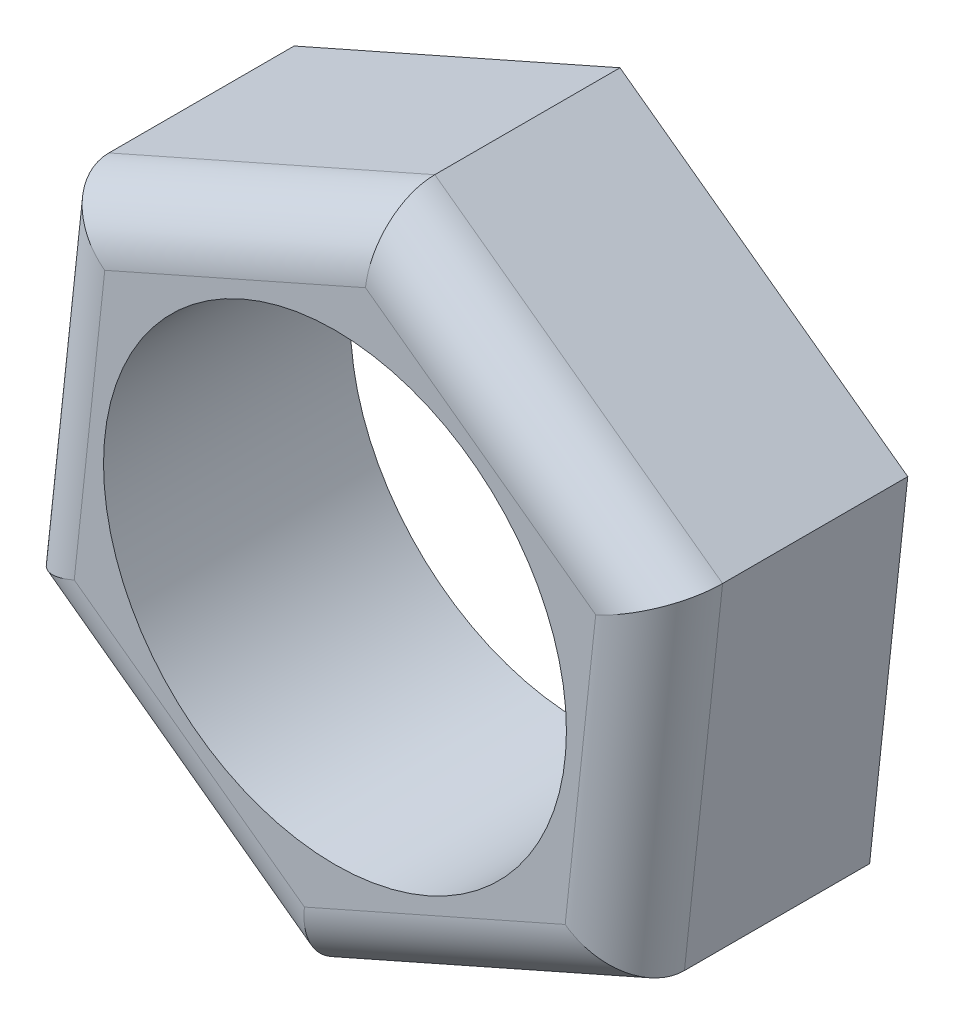
ISO-10303-21;
HEADER;
FILE_DESCRIPTION(('STEP AP214'),'2;1');
FILE_NAME('part.step','',(''),(''),'','','');
FILE_SCHEMA(('AUTOMOTIVE_DESIGN { 1 0 10303 214 1 1 1 1 }'));
ENDSEC;
DATA;
#1=APPLICATION_CONTEXT('core data for automotive mechanical design processes');
#2=APPLICATION_PROTOCOL_DEFINITION('international standard','automotive_design',2000,#1);
#3=PRODUCT_CONTEXT('',#1,'mechanical');
#4=PRODUCT('Part','Part','',(#3));
#5=PRODUCT_RELATED_PRODUCT_CATEGORY('part','',(#4));
#6=PRODUCT_DEFINITION_FORMATION('','',#4);
#7=PRODUCT_DEFINITION_CONTEXT('part definition',#1,'design');
#8=PRODUCT_DEFINITION('design','',#6,#7);
#9=PRODUCT_DEFINITION_SHAPE('','',#8);
#10=(LENGTH_UNIT() NAMED_UNIT(*) SI_UNIT(.MILLI.,.METRE.));
#11=(NAMED_UNIT(*) PLANE_ANGLE_UNIT() SI_UNIT($,.RADIAN.));
#12=(NAMED_UNIT(*) SI_UNIT($,.STERADIAN.) SOLID_ANGLE_UNIT());
#13=UNCERTAINTY_MEASURE_WITH_UNIT(LENGTH_MEASURE(1.E-05),#10,'distance_accuracy_value','');
#14=(GEOMETRIC_REPRESENTATION_CONTEXT(3) GLOBAL_UNCERTAINTY_ASSIGNED_CONTEXT((#13)) GLOBAL_UNIT_ASSIGNED_CONTEXT((#10,
#11,#12)) REPRESENTATION_CONTEXT('',''));
#15=CARTESIAN_POINT('',(0.,0.,0.));
#16=DIRECTION('',(0.,0.,1.));
#17=DIRECTION('',(1.,0.,0.));
#18=AXIS2_PLACEMENT_3D('',#15,#16,#17);
#19=CARTESIAN_POINT('',(0.,0.,5.07999999999997));
#20=DIRECTION('',(0.,0.,1.));
#21=DIRECTION('',(1.00000000000002,0.,0.));
#22=AXIS2_PLACEMENT_3D('',#19,#20,#21);
#23=PLANE('',#22);
#24=DIRECTION('',(-0.107052795571774,-0.994253337414733,0.));
#25=VECTOR('',#24,1.);
#26=CARTESIAN_POINT('',(-5.44328115223156,-3.10127774168979,5.07999999999997));
#27=LINE('',#26,#25);
#28=CARTESIAN_POINT('',(-4.73682759553516,3.45991295605974,5.07999999999997));
#29=VERTEX_POINT('',#28);
#30=CARTESIAN_POINT('',(-5.36478631260001,-2.37225655305162,5.07999999999997));
#31=VERTEX_POINT('',#30);
#32=EDGE_CURVE('E155',#29,#31,#27,.T.);
#33=ORIENTED_EDGE('',*,*,#32,.T.);
#34=DIRECTION('',(0.807522250212721,-0.589837109218645,0.));
#35=VECTOR('',#34,1.);
#36=CARTESIAN_POINT('',(-0.0358552676213153,-6.26465862861823,5.07999999999997));
#37=LINE('',#36,#35);
#38=CARTESIAN_POINT('',(-0.627958717063656,-5.83216950911078,5.07999999999997));
#39=VERTEX_POINT('',#38);
#40=EDGE_CURVE('E163',#31,#39,#37,.T.);
#41=ORIENTED_EDGE('',*,*,#40,.T.);
#42=DIRECTION('',(0.914575045784498,0.404416228196088,0.));
#43=VECTOR('',#42,1.);
#44=CARTESIAN_POINT('',(5.40742588460988,-3.16338088692858,5.07999999999997));
#45=LINE('',#44,#43);
#46=CARTESIAN_POINT('',(4.73682759553512,-3.45991295605977,5.07999999999997));
#47=VERTEX_POINT('',#46);
#48=EDGE_CURVE('E161',#39,#47,#45,.T.);
#49=ORIENTED_EDGE('',*,*,#48,.T.);
#50=DIRECTION('',(0.107052795571774,0.994253337414734,0.));
#51=VECTOR('',#50,1.);
#52=CARTESIAN_POINT('',(5.44328115223112,3.10127774168945,5.07999999999997));
#53=LINE('',#52,#51);
#54=CARTESIAN_POINT('',(5.36478631259799,2.37225655305062,5.07999999999997));
#55=VERTEX_POINT('',#54);
#56=EDGE_CURVE('E159',#47,#55,#53,.T.);
#57=ORIENTED_EDGE('',*,*,#56,.T.);
#58=DIRECTION('',(-0.807522250212718,0.589837109218643,0.));
#59=VECTOR('',#58,1.);
#60=CARTESIAN_POINT('',(0.0358552676211488,6.26465862861791,5.07999999999997));
#61=LINE('',#60,#59);
#62=CARTESIAN_POINT('',(0.627958717063143,5.83216950911047,5.07999999999997));
#63=VERTEX_POINT('',#62);
#64=EDGE_CURVE('E157',#55,#63,#61,.T.);
#65=ORIENTED_EDGE('',*,*,#64,.T.);
#66=DIRECTION('',(-0.914575045784497,-0.404416228196088,0.));
#67=VECTOR('',#66,1.);
#68=CARTESIAN_POINT('',(-5.40742588461005,3.16338088692839,5.07999999999997));
#69=LINE('',#68,#67);
#70=EDGE_CURVE('E113',#63,#29,#69,.T.);
#71=ORIENTED_EDGE('',*,*,#70,.T.);
#72=EDGE_LOOP('',(#33,#41,#49,#57,#65,#71));
#73=FACE_BOUND('',#72,.T.);
#74=CARTESIAN_POINT('',(0.,0.,5.07999999999997));
#75=DIRECTION('',(0.,0.,1.));
#76=DIRECTION('',(1.00000000000002,0.,0.));
#77=AXIS2_PLACEMENT_3D('',#74,#75,#76);
#78=CIRCLE('',#77,4.7625);
#79=CARTESIAN_POINT('',(4.76250000000011,0.,5.07999999999997));
#80=VERTEX_POINT('',#79);
#81=EDGE_CURVE('E130',#80,#80,#78,.T.);
#82=ORIENTED_EDGE('',*,*,#81,.F.);
#83=EDGE_LOOP('',(#82));
#84=FACE_BOUND('',#83,.T.);
#85=ADVANCED_FACE('F32',(#73,#84),#23,.T.);
#86=CARTESIAN_POINT('',(0.,0.,0.));
#87=DIRECTION('',(0.,0.,1.));
#88=DIRECTION('',(1.00000000000002,0.,0.));
#89=AXIS2_PLACEMENT_3D('',#86,#87,#88);
#90=PLANE('',#89);
#91=DIRECTION('',(0.107052795571774,0.994253337414734,0.));
#92=VECTOR('',#91,1.);
#93=CARTESIAN_POINT('',(5.9210344944189,-4.32489119507476,0.));
#94=LINE('',#93,#92);
#95=CARTESIAN_POINT('',(5.9210344944189,-4.32489119507476,0.));
#96=VERTEX_POINT('',#95);
#97=CARTESIAN_POINT('',(6.70598289074778,2.96532069131339,0.));
#98=VERTEX_POINT('',#97);
#99=EDGE_CURVE('E121',#96,#98,#94,.T.);
#100=ORIENTED_EDGE('',*,*,#99,.F.);
#101=DIRECTION('',(0.914575045784497,0.404416228196088,0.));
#102=VECTOR('',#101,1.);
#103=CARTESIAN_POINT('',(-0.784948396328949,-7.29021188638812,0.));
#104=LINE('',#103,#102);
#105=CARTESIAN_POINT('',(-0.784948396328949,-7.29021188638812,0.));
#106=VERTEX_POINT('',#105);
#107=EDGE_CURVE('E144',#106,#96,#104,.T.);
#108=ORIENTED_EDGE('',*,*,#107,.F.);
#109=DIRECTION('',(0.807522250212718,-0.589837109218643,0.));
#110=VECTOR('',#109,1.);
#111=CARTESIAN_POINT('',(-6.70598289074804,-2.96532069131353,0.));
#112=LINE('',#111,#110);
#113=CARTESIAN_POINT('',(-6.70598289074804,-2.96532069131353,0.));
#114=VERTEX_POINT('',#113);
#115=EDGE_CURVE('E141',#114,#106,#112,.T.);
#116=ORIENTED_EDGE('',*,*,#115,.F.);
#117=DIRECTION('',(-0.107052795571774,-0.994253337414734,0.));
#118=VECTOR('',#117,1.);
#119=CARTESIAN_POINT('',(-5.92103449441898,4.32489119507473,0.));
#120=LINE('',#119,#118);
#121=CARTESIAN_POINT('',(-5.92103449441898,4.32489119507473,0.));
#122=VERTEX_POINT('',#121);
#123=EDGE_CURVE('E138',#122,#114,#120,.T.);
#124=ORIENTED_EDGE('',*,*,#123,.F.);
#125=DIRECTION('',(-0.914575045784497,-0.404416228196088,0.));
#126=VECTOR('',#125,1.);
#127=CARTESIAN_POINT('',(0.784948396328589,7.29021188638795,0.));
#128=LINE('',#127,#126);
#129=CARTESIAN_POINT('',(0.784948396328589,7.29021188638795,0.));
#130=VERTEX_POINT('',#129);
#131=EDGE_CURVE('E124',#130,#122,#128,.T.);
#132=ORIENTED_EDGE('',*,*,#131,.F.);
#133=DIRECTION('',(-0.80752225021272,0.589837109218648,0.));
#134=VECTOR('',#133,1.);
#135=CARTESIAN_POINT('',(6.70598289074778,2.96532069131339,0.));
#136=LINE('',#135,#134);
#137=EDGE_CURVE('E106',#98,#130,#136,.T.);
#138=ORIENTED_EDGE('',*,*,#137,.F.);
#139=EDGE_LOOP('',(#100,#108,#116,#124,#132,#138));
#140=FACE_BOUND('',#139,.T.);
#141=CARTESIAN_POINT('',(0.,0.,0.));
#142=DIRECTION('',(0.,0.,1.));
#143=DIRECTION('',(1.00000000000002,0.,0.));
#144=AXIS2_PLACEMENT_3D('',#141,#142,#143);
#145=CIRCLE('',#144,4.7625);
#146=CARTESIAN_POINT('',(4.76250000000011,0.,0.));
#147=VERTEX_POINT('',#146);
#148=EDGE_CURVE('E133',#147,#147,#145,.T.);
#149=ORIENTED_EDGE('',*,*,#148,.T.);
#150=EDGE_LOOP('',(#149));
#151=FACE_BOUND('',#150,.T.);
#152=ADVANCED_FACE('F118',(#140,#151),#90,.F.);
#153=CARTESIAN_POINT('',(5.9210344944189,-4.32489119507476,5.07999999999997));
#154=DIRECTION('',(-0.994253337414722,0.107052795571752,0.));
#155=DIRECTION('',(-0.107052795571774,-0.994253337414734,0.));
#156=AXIS2_PLACEMENT_3D('',#153,#154,#155);
#157=PLANE('',#156);
#158=DIRECTION('',(0.,0.,-1.));
#159=VECTOR('',#158,1.);
#160=CARTESIAN_POINT('',(6.70598289074778,2.96532069131339,5.07999999999997));
#161=LINE('',#160,#159);
#162=CARTESIAN_POINT('',(6.70598289074778,2.96532069131339,3.80999999999998));
#163=VERTEX_POINT('',#162);
#164=EDGE_CURVE('E103',#163,#98,#161,.T.);
#165=ORIENTED_EDGE('',*,*,#164,.F.);
#166=DIRECTION('',(0.107052795571774,0.994253337414734,0.));
#167=VECTOR('',#166,1.);
#168=CARTESIAN_POINT('',(5.9210344944189,-4.32489119507476,3.80999999999998));
#169=LINE('',#168,#167);
#170=CARTESIAN_POINT('',(5.9210344944189,-4.32489119507476,3.80999999999998));
#171=VERTEX_POINT('',#170);
#172=EDGE_CURVE('E171',#163,#171,#169,.F.);
#173=ORIENTED_EDGE('',*,*,#172,.T.);
#174=DIRECTION('',(0.,0.,-1.));
#175=VECTOR('',#174,1.);
#176=CARTESIAN_POINT('',(5.9210344944189,-4.32489119507476,5.07999999999997));
#177=LINE('',#176,#175);
#178=EDGE_CURVE('E128',#171,#96,#177,.T.);
#179=ORIENTED_EDGE('',*,*,#178,.T.);
#180=ORIENTED_EDGE('',*,*,#99,.T.);
#181=EDGE_LOOP('',(#165,#173,#179,#180));
#182=FACE_BOUND('',#181,.T.);
#183=ADVANCED_FACE('F126',(#182),#157,.F.);
#184=CARTESIAN_POINT('',(6.70598289074778,2.96532069131339,5.07999999999997));
#185=DIRECTION('',(-0.58983710921866,-0.807522250212745,0.));
#186=DIRECTION('',(0.807522250212718,-0.589837109218643,0.));
#187=AXIS2_PLACEMENT_3D('',#184,#185,#186);
#188=PLANE('',#187);
#189=DIRECTION('',(0.,0.,-1.));
#190=VECTOR('',#189,1.);
#191=CARTESIAN_POINT('',(0.784948396328589,7.29021188638795,5.07999999999997));
#192=LINE('',#191,#190);
#193=CARTESIAN_POINT('',(0.784948396328589,7.29021188638795,3.80999999999998));
#194=VERTEX_POINT('',#193);
#195=EDGE_CURVE('E114',#194,#130,#192,.T.);
#196=ORIENTED_EDGE('',*,*,#195,.F.);
#197=DIRECTION('',(-0.807522250212718,0.589837109218643,0.));
#198=VECTOR('',#197,1.);
#199=CARTESIAN_POINT('',(6.70598289074778,2.96532069131339,3.80999999999998));
#200=LINE('',#199,#198);
#201=EDGE_CURVE('E109',#194,#163,#200,.F.);
#202=ORIENTED_EDGE('',*,*,#201,.T.);
#203=ORIENTED_EDGE('',*,*,#164,.T.);
#204=ORIENTED_EDGE('',*,*,#137,.T.);
#205=EDGE_LOOP('',(#196,#202,#203,#204));
#206=FACE_BOUND('',#205,.T.);
#207=ADVANCED_FACE('F105',(#206),#188,.F.);
#208=CARTESIAN_POINT('',(0.784948396328589,7.29021188638795,5.07999999999997));
#209=DIRECTION('',(0.404416228196063,-0.914575045784498,0.));
#210=DIRECTION('',(0.914575045784497,0.404416228196088,0.));
#211=AXIS2_PLACEMENT_3D('',#208,#209,#210);
#212=PLANE('',#211);
#213=DIRECTION('',(0.,0.,-1.));
#214=VECTOR('',#213,1.);
#215=CARTESIAN_POINT('',(-5.92103449441898,4.32489119507473,5.07999999999997));
#216=LINE('',#215,#214);
#217=CARTESIAN_POINT('',(-5.92103449441898,4.32489119507473,3.80999999999998));
#218=VERTEX_POINT('',#217);
#219=EDGE_CURVE('E151',#218,#122,#216,.T.);
#220=ORIENTED_EDGE('',*,*,#219,.F.);
#221=DIRECTION('',(-0.914575045784497,-0.404416228196088,0.));
#222=VECTOR('',#221,1.);
#223=CARTESIAN_POINT('',(0.784948396328589,7.29021188638795,3.80999999999998));
#224=LINE('',#223,#222);
#225=EDGE_CURVE('E11',#218,#194,#224,.F.);
#226=ORIENTED_EDGE('',*,*,#225,.T.);
#227=ORIENTED_EDGE('',*,*,#195,.T.);
#228=ORIENTED_EDGE('',*,*,#131,.T.);
#229=EDGE_LOOP('',(#220,#226,#227,#228));
#230=FACE_BOUND('',#229,.T.);
#231=ADVANCED_FACE('F225',(#230),#212,.F.);
#232=CARTESIAN_POINT('',(-5.92103449441898,4.32489119507473,5.07999999999997));
#233=DIRECTION('',(0.994253337414722,-0.107052795571752,0.));
#234=DIRECTION('',(0.107052795571774,0.994253337414733,0.));
#235=AXIS2_PLACEMENT_3D('',#232,#233,#234);
#236=PLANE('',#235);
#237=DIRECTION('',(0.,0.,-1.));
#238=VECTOR('',#237,1.);
#239=CARTESIAN_POINT('',(-6.70598289074804,-2.96532069131353,5.07999999999997));
#240=LINE('',#239,#238);
#241=CARTESIAN_POINT('',(-6.70598289074804,-2.96532069131353,3.80999999999998));
#242=VERTEX_POINT('',#241);
#243=EDGE_CURVE('E149',#242,#114,#240,.T.);
#244=ORIENTED_EDGE('',*,*,#243,.F.);
#245=DIRECTION('',(-0.107052795571774,-0.994253337414733,0.));
#246=VECTOR('',#245,1.);
#247=CARTESIAN_POINT('',(-5.92103449441898,4.32489119507473,3.80999999999998));
#248=LINE('',#247,#246);
#249=EDGE_CURVE('E41',#242,#218,#248,.F.);
#250=ORIENTED_EDGE('',*,*,#249,.T.);
#251=ORIENTED_EDGE('',*,*,#219,.T.);
#252=ORIENTED_EDGE('',*,*,#123,.T.);
#253=EDGE_LOOP('',(#244,#250,#251,#252));
#254=FACE_BOUND('',#253,.T.);
#255=ADVANCED_FACE('F221',(#254),#236,.F.);
#256=CARTESIAN_POINT('',(-6.70598289074804,-2.96532069131353,5.07999999999997));
#257=DIRECTION('',(0.589837109218658,0.807522250212743,0.));
#258=DIRECTION('',(-0.807522250212721,0.589837109218645,0.));
#259=AXIS2_PLACEMENT_3D('',#256,#257,#258);
#260=PLANE('',#259);
#261=DIRECTION('',(0.,0.,-1.));
#262=VECTOR('',#261,1.);
#263=CARTESIAN_POINT('',(-0.784948396328949,-7.29021188638812,5.07999999999997));
#264=LINE('',#263,#262);
#265=CARTESIAN_POINT('',(-0.784948396328949,-7.29021188638812,3.80999999999998));
#266=VERTEX_POINT('',#265);
#267=EDGE_CURVE('E147',#266,#106,#264,.T.);
#268=ORIENTED_EDGE('',*,*,#267,.F.);
#269=DIRECTION('',(0.807522250212721,-0.589837109218645,0.));
#270=VECTOR('',#269,1.);
#271=CARTESIAN_POINT('',(-6.70598289074804,-2.96532069131353,3.80999999999998));
#272=LINE('',#271,#270);
#273=EDGE_CURVE('E166',#266,#242,#272,.F.);
#274=ORIENTED_EDGE('',*,*,#273,.T.);
#275=ORIENTED_EDGE('',*,*,#243,.T.);
#276=ORIENTED_EDGE('',*,*,#115,.T.);
#277=EDGE_LOOP('',(#268,#274,#275,#276));
#278=FACE_BOUND('',#277,.T.);
#279=ADVANCED_FACE('F207',(#278),#260,.F.);
#280=CARTESIAN_POINT('',(-0.784948396328949,-7.29021188638812,5.07999999999997));
#281=DIRECTION('',(-0.404416228196063,0.914575045784497,0.));
#282=DIRECTION('',(-0.914575045784498,-0.404416228196088,0.));
#283=AXIS2_PLACEMENT_3D('',#280,#281,#282);
#284=PLANE('',#283);
#285=ORIENTED_EDGE('',*,*,#178,.F.);
#286=DIRECTION('',(0.914575045784498,0.404416228196088,0.));
#287=VECTOR('',#286,1.);
#288=CARTESIAN_POINT('',(-0.784948396328949,-7.29021188638812,3.80999999999998));
#289=LINE('',#288,#287);
#290=EDGE_CURVE('E169',#171,#266,#289,.F.);
#291=ORIENTED_EDGE('',*,*,#290,.T.);
#292=ORIENTED_EDGE('',*,*,#267,.T.);
#293=ORIENTED_EDGE('',*,*,#107,.T.);
#294=EDGE_LOOP('',(#285,#291,#292,#293));
#295=FACE_BOUND('',#294,.T.);
#296=ADVANCED_FACE('F198',(#295),#284,.F.);
#297=CARTESIAN_POINT('',(0.,0.,5.07999999999997));
#298=DIRECTION('',(0.,0.,-1.));
#299=DIRECTION('',(-1.00000000000002,0.,0.));
#300=AXIS2_PLACEMENT_3D('',#297,#298,#299);
#301=CYLINDRICAL_SURFACE('',#300,4.7625);
#302=ORIENTED_EDGE('',*,*,#81,.T.);
#303=EDGE_LOOP('',(#302));
#304=FACE_BOUND('',#303,.T.);
#305=ORIENTED_EDGE('',*,*,#148,.F.);
#306=EDGE_LOOP('',(#305));
#307=FACE_BOUND('',#306,.T.);
#308=ADVANCED_FACE('F196',(#304,#307),#301,.F.);
#309=CARTESIAN_POINT('',(2.99637251483062,4.1022130310806,3.80999999999998));
#310=DIRECTION('',(0.807522250212718,-0.589837109218643,0.));
#311=DIRECTION('',(0.58983710921866,0.807522250212745,0.));
#312=AXIS2_PLACEMENT_3D('',#309,#310,#311);
#313=CYLINDRICAL_SURFACE('',#312,1.27);
#314=CARTESIAN_POINT('',(5.36478631259799,2.37225655305062,3.80999999999998));
#315=DIRECTION('',(0.404416228196063,-0.914575045784496,0.));
#316=DIRECTION('',(0.914575045784498,0.404416228196088,0.));
#317=AXIS2_PLACEMENT_3D('',#314,#315,#316);
#318=ELLIPSE('',#317,1.46646968374165,1.27);
#319=EDGE_CURVE('E184',#163,#55,#318,.T.);
#320=ORIENTED_EDGE('',*,*,#319,.F.);
#321=ORIENTED_EDGE('',*,*,#201,.F.);
#322=CARTESIAN_POINT('',(0.627958717063143,5.83216950911047,3.80999999999998));
#323=DIRECTION('',(0.994253337414723,-0.107052795571751,0.));
#324=DIRECTION('',(0.107052795571774,0.994253337414733,0.));
#325=AXIS2_PLACEMENT_3D('',#322,#323,#324);
#326=ELLIPSE('',#325,1.46646968374165,1.27);
#327=EDGE_CURVE('E36',#63,#194,#326,.F.);
#328=ORIENTED_EDGE('',*,*,#327,.F.);
#329=ORIENTED_EDGE('',*,*,#64,.F.);
#330=EDGE_LOOP('',(#320,#321,#328,#329));
#331=FACE_BOUND('',#330,.T.);
#332=ADVANCED_FACE('F34',(#331),#313,.T.);
#333=CARTESIAN_POINT('',(-2.054434439236,4.646041232585,3.80999999999998));
#334=DIRECTION('',(0.914575045784497,0.404416228196088,0.));
#335=DIRECTION('',(-0.404416228196063,0.914575045784498,0.));
#336=AXIS2_PLACEMENT_3D('',#333,#334,#335);
#337=CYLINDRICAL_SURFACE('',#336,1.27);
#338=ORIENTED_EDGE('',*,*,#327,.T.);
#339=ORIENTED_EDGE('',*,*,#225,.F.);
#340=CARTESIAN_POINT('',(-4.73682759553516,3.45991295605974,3.80999999999998));
#341=DIRECTION('',(0.58983710921866,0.807522250212745,0.));
#342=DIRECTION('',(0.80752225021272,-0.589837109218648,0.));
#343=AXIS2_PLACEMENT_3D('',#340,#341,#342);
#344=ELLIPSE('',#343,1.46646968374165,1.27);
#345=EDGE_CURVE('E182',#29,#218,#344,.F.);
#346=ORIENTED_EDGE('',*,*,#345,.F.);
#347=ORIENTED_EDGE('',*,*,#70,.F.);
#348=EDGE_LOOP('',(#338,#339,#346,#347));
#349=FACE_BOUND('',#348,.T.);
#350=ADVANCED_FACE('F205',(#349),#337,.T.);
#351=CARTESIAN_POINT('',(5.05080695406672,-0.543828201504615,3.80999999999998));
#352=DIRECTION('',(-0.107052795571774,-0.994253337414734,0.));
#353=DIRECTION('',(0.994253337414722,-0.107052795571752,0.));
#354=AXIS2_PLACEMENT_3D('',#351,#352,#353);
#355=CYLINDRICAL_SURFACE('',#354,1.27);
#356=ORIENTED_EDGE('',*,*,#319,.T.);
#357=ORIENTED_EDGE('',*,*,#56,.F.);
#358=CARTESIAN_POINT('',(4.73682759553512,-3.45991295605977,3.80999999999998));
#359=DIRECTION('',(-0.58983710921866,-0.807522250212744,0.));
#360=DIRECTION('',(0.807522250212718,-0.589837109218643,0.));
#361=AXIS2_PLACEMENT_3D('',#358,#359,#360);
#362=ELLIPSE('',#361,1.46646968374165,1.27);
#363=EDGE_CURVE('E179',#171,#47,#362,.T.);
#364=ORIENTED_EDGE('',*,*,#363,.F.);
#365=ORIENTED_EDGE('',*,*,#172,.F.);
#366=EDGE_LOOP('',(#356,#357,#364,#365));
#367=FACE_BOUND('',#366,.T.);
#368=ADVANCED_FACE('F243',(#367),#355,.T.);
#369=CARTESIAN_POINT('',(-5.05080695406716,0.543828201504254,3.80999999999998));
#370=DIRECTION('',(0.107052795571774,0.994253337414733,0.));
#371=DIRECTION('',(-0.994253337414723,0.107052795571751,0.));
#372=AXIS2_PLACEMENT_3D('',#369,#370,#371);
#373=CYLINDRICAL_SURFACE('',#372,1.27);
#374=ORIENTED_EDGE('',*,*,#345,.T.);
#375=ORIENTED_EDGE('',*,*,#249,.F.);
#376=CARTESIAN_POINT('',(-5.36478631260001,-2.37225655305162,3.80999999999998));
#377=DIRECTION('',(-0.404416228196063,0.914575045784496,0.));
#378=DIRECTION('',(0.914575045784498,0.404416228196088,0.));
#379=AXIS2_PLACEMENT_3D('',#376,#377,#378);
#380=ELLIPSE('',#379,1.46646968374165,1.27);
#381=EDGE_CURVE('E177',#31,#242,#380,.F.);
#382=ORIENTED_EDGE('',*,*,#381,.F.);
#383=ORIENTED_EDGE('',*,*,#32,.F.);
#384=EDGE_LOOP('',(#374,#375,#382,#383));
#385=FACE_BOUND('',#384,.T.);
#386=ADVANCED_FACE('F239',(#385),#373,.T.);
#387=CARTESIAN_POINT('',(2.05443443923595,-4.64604123258518,3.80999999999998));
#388=DIRECTION('',(-0.914575045784498,-0.404416228196088,0.));
#389=DIRECTION('',(0.404416228196063,-0.914575045784497,0.));
#390=AXIS2_PLACEMENT_3D('',#387,#388,#389);
#391=CYLINDRICAL_SURFACE('',#390,1.27);
#392=ORIENTED_EDGE('',*,*,#363,.T.);
#393=ORIENTED_EDGE('',*,*,#48,.F.);
#394=CARTESIAN_POINT('',(-0.627958717063656,-5.83216950911078,3.80999999999998));
#395=DIRECTION('',(-0.994253337414721,0.107052795571752,0.));
#396=DIRECTION('',(-0.107052795571774,-0.994253337414734,0.));
#397=AXIS2_PLACEMENT_3D('',#394,#395,#396);
#398=ELLIPSE('',#397,1.46646968374165,1.27);
#399=EDGE_CURVE('E175',#266,#39,#398,.T.);
#400=ORIENTED_EDGE('',*,*,#399,.F.);
#401=ORIENTED_EDGE('',*,*,#290,.F.);
#402=EDGE_LOOP('',(#392,#393,#400,#401));
#403=FACE_BOUND('',#402,.T.);
#404=ADVANCED_FACE('F235',(#403),#391,.T.);
#405=CARTESIAN_POINT('',(-2.99637251483068,-4.1022130310806,3.80999999999998));
#406=DIRECTION('',(-0.807522250212721,0.589837109218645,0.));
#407=DIRECTION('',(-0.589837109218658,-0.807522250212743,0.));
#408=AXIS2_PLACEMENT_3D('',#405,#406,#407);
#409=CYLINDRICAL_SURFACE('',#408,1.27);
#410=ORIENTED_EDGE('',*,*,#381,.T.);
#411=ORIENTED_EDGE('',*,*,#273,.F.);
#412=ORIENTED_EDGE('',*,*,#399,.T.);
#413=ORIENTED_EDGE('',*,*,#40,.F.);
#414=EDGE_LOOP('',(#410,#411,#412,#413));
#415=FACE_BOUND('',#414,.T.);
#416=ADVANCED_FACE('F232',(#415),#409,.T.);
#417=CLOSED_SHELL('',(#85,#152,#183,#207,#231,#255,#279,#296,#308,#332,#350,#368,#386,#404,#416));
#418=MANIFOLD_SOLID_BREP('B2',#417);
#419=ADVANCED_BREP_SHAPE_REPRESENTATION('',(#18,#418),#14);
#420=SHAPE_DEFINITION_REPRESENTATION(#9,#419);
ENDSEC;
END-ISO-10303-21;
